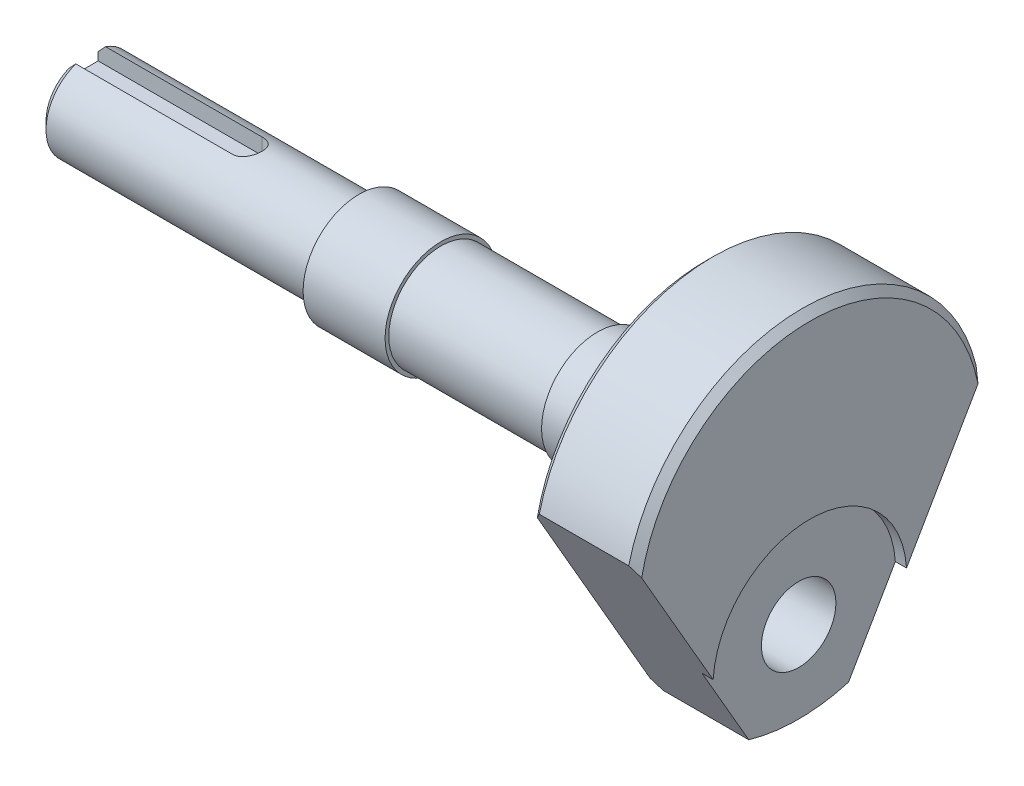
ISO-10303-21;
HEADER;
FILE_DESCRIPTION(('STEP AP214'),'2;1');
FILE_NAME('part.step','',(''),(''),'','','');
FILE_SCHEMA(('AUTOMOTIVE_DESIGN { 1 0 10303 214 1 1 1 1 }'));
ENDSEC;
DATA;
#1=APPLICATION_CONTEXT('core data for automotive mechanical design processes');
#2=APPLICATION_PROTOCOL_DEFINITION('international standard','automotive_design',2000,#1);
#3=PRODUCT_CONTEXT('',#1,'mechanical');
#4=PRODUCT('Part','Part','',(#3));
#5=PRODUCT_RELATED_PRODUCT_CATEGORY('part','',(#4));
#6=PRODUCT_DEFINITION_FORMATION('','',#4);
#7=PRODUCT_DEFINITION_CONTEXT('part definition',#1,'design');
#8=PRODUCT_DEFINITION('design','',#6,#7);
#9=PRODUCT_DEFINITION_SHAPE('','',#8);
#10=(LENGTH_UNIT() NAMED_UNIT(*) SI_UNIT(.MILLI.,.METRE.));
#11=(NAMED_UNIT(*) PLANE_ANGLE_UNIT() SI_UNIT($,.RADIAN.));
#12=(NAMED_UNIT(*) SI_UNIT($,.STERADIAN.) SOLID_ANGLE_UNIT());
#13=UNCERTAINTY_MEASURE_WITH_UNIT(LENGTH_MEASURE(1.E-05),#10,'distance_accuracy_value','');
#14=(GEOMETRIC_REPRESENTATION_CONTEXT(3) GLOBAL_UNCERTAINTY_ASSIGNED_CONTEXT((#13)) GLOBAL_UNIT_ASSIGNED_CONTEXT((#10,
#11,#12)) REPRESENTATION_CONTEXT('',''));
#15=CARTESIAN_POINT('',(0.,0.,0.));
#16=DIRECTION('',(0.,0.,1.));
#17=DIRECTION('',(1.,0.,0.));
#18=AXIS2_PLACEMENT_3D('',#15,#16,#17);
#19=CARTESIAN_POINT('',(0.,0.,0.));
#20=DIRECTION('',(-1.,0.,0.));
#21=DIRECTION('',(0.,0.,1.));
#22=AXIS2_PLACEMENT_3D('',#19,#20,#21);
#23=CYLINDRICAL_SURFACE('',#22,6.);
#24=CARTESIAN_POINT('',(37.,0.,0.));
#25=DIRECTION('',(-1.,0.,0.));
#26=DIRECTION('',(0.,0.,1.));
#27=AXIS2_PLACEMENT_3D('',#24,#25,#26);
#28=CIRCLE('',#27,6.);
#29=CARTESIAN_POINT('',(37.,0.,6.));
#30=VERTEX_POINT('',#29);
#31=EDGE_CURVE('E341',#30,#30,#28,.T.);
#32=ORIENTED_EDGE('',*,*,#31,.T.);
#33=EDGE_LOOP('',(#32));
#34=FACE_BOUND('',#33,.T.);
#35=CARTESIAN_POINT('',(22.,5.65685424949238,-2.));
#36=CARTESIAN_POINT('',(21.8910636503278,5.65685389060868,-2.00000051589543));
#37=CARTESIAN_POINT('',(21.7821304003528,5.66003538581715,-1.99106956737105));
#38=CARTESIAN_POINT('',(21.5674911580115,5.6723514816251,-1.95570226337762));
#39=CARTESIAN_POINT('',(21.461785700255,5.68148706284377,-1.9292630243368));
#40=CARTESIAN_POINT('',(21.2567462140054,5.70456407377583,-1.85991097136981));
#41=CARTESIAN_POINT('',(21.1574001411146,5.71849607942644,-1.81703044280649));
#42=CARTESIAN_POINT('',(20.9672799029041,5.74958244020649,-1.71612325688276));
#43=CARTESIAN_POINT('',(20.8765076348927,5.76673750607225,-1.65809325772037));
#44=CARTESIAN_POINT('',(20.7025600753234,5.80308978814946,-1.52610229288576));
#45=CARTESIAN_POINT('',(20.6197691426565,5.82233789689288,-1.45164868275584));
#46=CARTESIAN_POINT('',(20.4675863975507,5.86027729602006,-1.28997533442879));
#47=CARTESIAN_POINT('',(20.3981967368352,5.87896849657923,-1.20275355010475));
#48=CARTESIAN_POINT('',(20.2730422053408,5.91427733843598,-1.01520901593002));
#49=CARTESIAN_POINT('',(20.2176800587641,5.93082815403211,-0.914603822449051));
#50=CARTESIAN_POINT('',(20.124816829745,5.95939173541966,-0.704862445974947));
#51=CARTESIAN_POINT('',(20.0873109336462,5.97140572406004,-0.595728571374423));
#52=CARTESIAN_POINT('',(20.0325282907352,5.98918150863813,-0.376057634866987));
#53=CARTESIAN_POINT('',(20.014593107486,5.99514629555118,-0.265701509705935));
#54=CARTESIAN_POINT('',(19.9973674132787,6.00087216436496,-0.0433957496481767));
#55=CARTESIAN_POINT('',(19.9980720966952,6.00063484525791,0.0685534670877949));
#56=CARTESIAN_POINT('',(20.017688509132,5.99412079237463,0.286207030387632));
#57=CARTESIAN_POINT('',(20.035885056949,5.98808129510235,0.391984097183316));
#58=CARTESIAN_POINT('',(20.0887859619609,5.97093934679463,0.598886877644346));
#59=CARTESIAN_POINT('',(20.1234914379596,5.95983655262363,0.700012275558435));
#60=CARTESIAN_POINT('',(20.2088426346121,5.93351340586448,0.896304949683949));
#61=CARTESIAN_POINT('',(20.259691877093,5.91824085048031,0.991376441937694));
#62=CARTESIAN_POINT('',(20.3757194108973,5.88516786077838,1.17184865105465));
#63=CARTESIAN_POINT('',(20.4409016866553,5.86736672402934,1.25724666877069));
#64=CARTESIAN_POINT('',(20.5873487869194,5.83012383699793,1.42020173310262));
#65=CARTESIAN_POINT('',(20.669226315683,5.81064430337755,1.49720031413055));
#66=CARTESIAN_POINT('',(20.8448974514532,5.77294670497801,1.63655451919635));
#67=CARTESIAN_POINT('',(20.9386928914561,5.75472883491231,1.69890788656309));
#68=CARTESIAN_POINT('',(21.1373072512069,5.72141050242224,1.80797491007149));
#69=CARTESIAN_POINT('',(21.2422642626355,5.70635818569496,1.85445292724268));
#70=CARTESIAN_POINT('',(21.4591427884288,5.68163301648769,1.92888638653868));
#71=CARTESIAN_POINT('',(21.5710613624125,5.67195790974185,1.95684959149499));
#72=CARTESIAN_POINT('',(21.7932767108231,5.6595927263117,1.99232256419505));
#73=CARTESIAN_POINT('',(21.9034188494973,5.65660720637512,2.00069819101527));
#74=CARTESIAN_POINT('',(22.1235522982282,5.65713344118369,1.99921087781944));
#75=CARTESIAN_POINT('',(22.233543632048,5.66064401583629,1.98935125045353));
#76=CARTESIAN_POINT('',(22.4463139314238,5.67347236180599,1.95245130310462));
#77=CARTESIAN_POINT('',(22.5492108603017,5.6825865088168,1.92601278796137));
#78=CARTESIAN_POINT('',(22.7490872124784,5.70537107342046,1.85742772512094));
#79=CARTESIAN_POINT('',(22.8460655831815,5.71904229869679,1.81527839272685));
#80=CARTESIAN_POINT('',(23.034760841694,5.74993755191574,1.71494868147788));
#81=CARTESIAN_POINT('',(23.1262132852836,5.76726051331256,1.656302236717));
#82=CARTESIAN_POINT('',(23.2982921047674,5.8033153746193,1.52517126111512));
#83=CARTESIAN_POINT('',(23.3789152773224,5.82204768887589,1.45268265099756));
#84=CARTESIAN_POINT('',(23.5310559681813,5.85990077275698,1.29178341180065));
#85=CARTESIAN_POINT('',(23.6019487800377,5.87899687155793,1.2027745410933));
#86=CARTESIAN_POINT('',(23.7278322846961,5.91453703226217,1.01365458280051));
#87=CARTESIAN_POINT('',(23.7828235423248,5.93098118835389,0.913543889729104));
#88=CARTESIAN_POINT('',(23.8748402097234,5.95928811621206,0.70555972486459));
#89=CARTESIAN_POINT('',(23.9119825542961,5.97118060009062,0.597742246642392));
#90=CARTESIAN_POINT('',(23.9674554841202,5.98917221675549,0.376916931692032));
#91=CARTESIAN_POINT('',(23.985792859761,5.99527344068038,0.263910983907778));
#92=CARTESIAN_POINT('',(24.0025241552113,6.00083726472513,0.0416306717200808));
#93=CARTESIAN_POINT('',(24.0018149078647,6.00059840178878,-0.0675694478400379));
#94=CARTESIAN_POINT('',(23.9826853837072,5.99424393038796,-0.284222290000349));
#95=CARTESIAN_POINT('',(23.9642665436945,5.98812879867152,-0.391675153638116));
#96=CARTESIAN_POINT('',(23.9108355308481,5.97081829908825,-0.60008423886412));
#97=CARTESIAN_POINT('',(23.8760915692941,5.95970516722297,-0.70111654182558));
#98=CARTESIAN_POINT('',(23.7912449378057,5.9335432140899,-0.895956701879594));
#99=CARTESIAN_POINT('',(23.741139489606,5.91849368096033,-0.989763248284868));
#100=CARTESIAN_POINT('',(23.624860975796,5.88531737655762,-1.17126803261757));
#101=CARTESIAN_POINT('',(23.5581626292367,5.86709744983853,-1.25861250311522));
#102=CARTESIAN_POINT('',(23.4114852176876,5.82985977583759,-1.42116205254486));
#103=CARTESIAN_POINT('',(23.3315019154745,5.81084177546194,-1.49636324324919));
#104=CARTESIAN_POINT('',(23.1567812888261,5.77326559651196,-1.63548361766624));
#105=CARTESIAN_POINT('',(23.0615889780467,5.75475455977261,-1.69884593199581));
#106=CARTESIAN_POINT('',(22.8613311461944,5.7212038664603,-1.80862868660223));
#107=CARTESIAN_POINT('',(22.7562682139407,5.70616330322498,-1.85505355363895));
#108=CARTESIAN_POINT('',(22.5440763519687,5.68202668413029,-1.92768765640833));
#109=CARTESIAN_POINT('',(22.4372554729493,5.67269265714364,-1.95471581829904));
#110=CARTESIAN_POINT('',(22.2202878990666,5.66010767079036,-1.99086864029854));
#111=CARTESIAN_POINT('',(22.1101423651786,5.65685461234922,-1.99999947839319));
#112=CARTESIAN_POINT('',(22.,5.65685424949238,-2.));
#113=B_SPLINE_CURVE_WITH_KNOTS('',3,(#35,#36,#37,#38,#39,#40,#41,#42,#43,#44,#45,#46,#47,#48,
#49,#50,#51,#52,#53,#54,#55,#56,#57,#58,#59,#60,#61,#62,#63,#64,#65,#66,#67,#68,#69,#70,#71,#72,
#73,#74,#75,#76,#77,#78,#79,#80,#81,#82,#83,#84,#85,#86,#87,#88,#89,#90,#91,#92,#93,#94,#95,#96,
#97,#98,#99,#100,#101,#102,#103,#104,#105,#106,#107,#108,#109,#110,#111,#112),.UNSPECIFIED.,.T.,
.F.,(4,2,2,2,2,2,2,2,2,2,2,2,2,2,2,2,2,2,2,2,2,2,2,2,2,2,2,2,2,2,2,2,2,2,2,2,2,2,4),(0.,
0.326401169598714,0.65285611003033,0.978673255001661,1.30456233237089,1.64202674855137,
1.97954530343976,2.32587012287315,2.67210152773579,3.00628637529869,3.34038506604655,
3.66138009651139,3.98239688378474,4.30763309720671,4.63295983748045,4.97360348727836,
5.31429959224213,5.65985279686112,6.00526102713233,6.3350858272888,6.66485071674468,
6.98328791537553,7.30178158293892,7.63037715471431,7.95906971324256,8.30357616342187,
8.64807037515066,8.99027582381705,9.33235766008315,9.65836169355272,9.98433928019564,
10.3051391208086,10.6259970152649,10.9587103904127,11.2915300886526,11.6373780547229,
11.9831355653374,12.3132642432538,12.6432789438093),.UNSPECIFIED.);
#114=CARTESIAN_POINT('',(22.,5.65685424949238,2.));
#115=VERTEX_POINT('',#114);
#116=CARTESIAN_POINT('',(22.,5.65685424949238,-2.));
#117=VERTEX_POINT('',#116);
#118=EDGE_CURVE('E178',#115,#117,#113,.T.);
#119=ORIENTED_EDGE('',*,*,#118,.F.);
#120=DIRECTION('',(-1.,0.,0.));
#121=VECTOR('',#120,1.);
#122=CARTESIAN_POINT('',(0.,5.65685424949238,2.));
#123=LINE('',#122,#121);
#124=CARTESIAN_POINT('',(1.,5.65685424949238,2.));
#125=VERTEX_POINT('',#124);
#126=EDGE_CURVE('E438',#115,#125,#123,.T.);
#127=ORIENTED_EDGE('',*,*,#126,.T.);
#128=CARTESIAN_POINT('',(1.,0.,0.));
#129=DIRECTION('',(1.,0.,0.));
#130=DIRECTION('',(0.,0.,-1.));
#131=AXIS2_PLACEMENT_3D('',#128,#129,#130);
#132=CIRCLE('',#131,6.);
#133=CARTESIAN_POINT('',(1.,5.65685424949238,-2.));
#134=VERTEX_POINT('',#133);
#135=EDGE_CURVE('E335',#125,#134,#132,.T.);
#136=ORIENTED_EDGE('',*,*,#135,.T.);
#137=DIRECTION('',(-1.,0.,0.));
#138=VECTOR('',#137,1.);
#139=CARTESIAN_POINT('',(0.,5.65685424949238,-2.));
#140=LINE('',#139,#138);
#141=EDGE_CURVE('E440',#134,#117,#140,.F.);
#142=ORIENTED_EDGE('',*,*,#141,.T.);
#143=EDGE_LOOP('',(#119,#127,#136,#142));
#144=FACE_BOUND('',#143,.T.);
#145=ADVANCED_FACE('F43',(#34,#144),#23,.T.);
#146=CARTESIAN_POINT('',(0.,0.,0.));
#147=DIRECTION('',(-1.,0.,0.));
#148=DIRECTION('',(0.,0.,1.));
#149=AXIS2_PLACEMENT_3D('',#146,#147,#148);
#150=CYLINDRICAL_SURFACE('',#149,24.);
#151=CARTESIAN_POINT('',(96.,0.,0.));
#152=DIRECTION('',(1.,0.,0.));
#153=DIRECTION('',(0.,0.,-1.));
#154=AXIS2_PLACEMENT_3D('',#151,#152,#153);
#155=CIRCLE('',#154,24.);
#156=CARTESIAN_POINT('',(96.,-23.0477486077825,6.69337613708202));
#157=VERTEX_POINT('',#156);
#158=CARTESIAN_POINT('',(96.,-23.0477486077825,-6.69337613708202));
#159=VERTEX_POINT('',#158);
#160=EDGE_CURVE('E403',#157,#159,#155,.T.);
#161=ORIENTED_EDGE('',*,*,#160,.F.);
#162=DIRECTION('',(-1.,0.,0.));
#163=VECTOR('',#162,1.);
#164=CARTESIAN_POINT('',(0.,-23.0477486077825,6.69337613708203));
#165=LINE('',#164,#163);
#166=CARTESIAN_POINT('',(84.5,-23.0477486077825,6.69337613708202));
#167=VERTEX_POINT('',#166);
#168=EDGE_CURVE('E391',#167,#157,#165,.F.);
#169=ORIENTED_EDGE('',*,*,#168,.F.);
#170=CARTESIAN_POINT('',(84.5,0.,0.));
#171=DIRECTION('',(1.,0.,0.));
#172=DIRECTION('',(0.,0.,-1.));
#173=AXIS2_PLACEMENT_3D('',#170,#171,#172);
#174=CIRCLE('',#173,24.);
#175=CARTESIAN_POINT('',(84.5,-23.0477486077825,-6.69337613708202));
#176=VERTEX_POINT('',#175);
#177=EDGE_CURVE('E334',#167,#176,#174,.T.);
#178=ORIENTED_EDGE('',*,*,#177,.T.);
#179=DIRECTION('',(-1.,0.,0.));
#180=VECTOR('',#179,1.);
#181=CARTESIAN_POINT('',(0.,-23.0477486077825,-6.69337613708202));
#182=LINE('',#181,#180);
#183=EDGE_CURVE('E376',#176,#159,#182,.F.);
#184=ORIENTED_EDGE('',*,*,#183,.T.);
#185=EDGE_LOOP('',(#161,#169,#178,#184));
#186=FACE_BOUND('',#185,.T.);
#187=ADVANCED_FACE('F226',(#186),#150,.T.);
#188=CARTESIAN_POINT('',(83.5,11.5,0.));
#189=DIRECTION('',(1.,0.,0.));
#190=DIRECTION('',(0.,0.,-1.));
#191=AXIS2_PLACEMENT_3D('',#188,#189,#190);
#192=PLANE('',#191);
#193=CARTESIAN_POINT('',(83.5,0.,0.));
#194=DIRECTION('',(-1.,0.,0.));
#195=DIRECTION('',(0.,0.,1.));
#196=AXIS2_PLACEMENT_3D('',#193,#194,#195);
#197=CIRCLE('',#196,11.5);
#198=CARTESIAN_POINT('',(83.5,-10.625,4.39992897669951));
#199=VERTEX_POINT('',#198);
#200=CARTESIAN_POINT('',(83.5,-10.625,-4.39992897669951));
#201=VERTEX_POINT('',#200);
#202=EDGE_CURVE('E365',#199,#201,#197,.T.);
#203=ORIENTED_EDGE('',*,*,#202,.F.);
#204=CARTESIAN_POINT('',(83.5,-13.,0.));
#205=DIRECTION('',(1.,0.,0.));
#206=DIRECTION('',(0.,0.,-1.));
#207=AXIS2_PLACEMENT_3D('',#204,#205,#206);
#208=CIRCLE('',#207,5.);
#209=EDGE_CURVE('E71',#199,#201,#208,.T.);
#210=ORIENTED_EDGE('',*,*,#209,.T.);
#211=EDGE_LOOP('',(#203,#210));
#212=FACE_BOUND('',#211,.T.);
#213=DIRECTION('',(0.,-0.86602540378444,-0.499999999999998));
#214=VECTOR('',#213,1.);
#215=CARTESIAN_POINT('',(83.5,-0.0352540378443338,19.9796460717606));
#216=LINE('',#215,#214);
#217=CARTESIAN_POINT('',(83.5,4.44508838423677,22.5663729752108));
#218=VERTEX_POINT('',#217);
#219=CARTESIAN_POINT('',(83.5,-21.7655964599255,7.43362702478934));
#220=VERTEX_POINT('',#219);
#221=EDGE_CURVE('E394',#218,#220,#216,.T.);
#222=ORIENTED_EDGE('',*,*,#221,.F.);
#223=CARTESIAN_POINT('',(83.5,0.,0.));
#224=DIRECTION('',(1.,0.,0.));
#225=DIRECTION('',(0.,0.,-1.));
#226=AXIS2_PLACEMENT_3D('',#223,#224,#225);
#227=CIRCLE('',#226,23.);
#228=CARTESIAN_POINT('',(83.5,4.44508838423677,-22.5663729752108));
#229=VERTEX_POINT('',#228);
#230=EDGE_CURVE('E321',#218,#229,#227,.F.);
#231=ORIENTED_EDGE('',*,*,#230,.T.);
#232=DIRECTION('',(0.,-0.86602540378444,0.499999999999998));
#233=VECTOR('',#232,1.);
#234=CARTESIAN_POINT('',(83.5,-0.0352540378443303,-19.9796460717606));
#235=LINE('',#234,#233);
#236=CARTESIAN_POINT('',(83.5,-21.7655964599255,-7.43362702478933));
#237=VERTEX_POINT('',#236);
#238=EDGE_CURVE('E379',#229,#237,#235,.T.);
#239=ORIENTED_EDGE('',*,*,#238,.T.);
#240=EDGE_CURVE('E317',#237,#220,#227,.F.);
#241=ORIENTED_EDGE('',*,*,#240,.T.);
#242=EDGE_LOOP('',(#222,#231,#239,#241));
#243=FACE_BOUND('',#242,.T.);
#244=ADVANCED_FACE('F224',(#212,#243),#192,.F.);
#245=DIRECTION('',(-1.,0.,0.));
#246=VECTOR('',#245,1.);
#247=CARTESIAN_POINT('',(367.531202733106,5.7272405320938,23.3066238629181));
#248=LINE('',#247,#246);
#249=CARTESIAN_POINT('',(96.5,5.7272405320938,23.3066238629181));
#250=VERTEX_POINT('',#249);
#251=CARTESIAN_POINT('',(84.5,5.7272405320938,23.3066238629181));
#252=VERTEX_POINT('',#251);
#253=EDGE_CURVE('E396',#250,#252,#248,.T.);
#254=ORIENTED_EDGE('',*,*,#253,.F.);
#255=CARTESIAN_POINT('',(96.5,0.,0.));
#256=DIRECTION('',(-1.,0.,0.));
#257=DIRECTION('',(0.,0.,1.));
#258=AXIS2_PLACEMENT_3D('',#255,#256,#257);
#259=CIRCLE('',#258,24.);
#260=CARTESIAN_POINT('',(96.5,5.7272405320938,-23.3066238629181));
#261=VERTEX_POINT('',#260);
#262=EDGE_CURVE('E329',#250,#261,#259,.T.);
#263=ORIENTED_EDGE('',*,*,#262,.T.);
#264=DIRECTION('',(-1.,0.,0.));
#265=VECTOR('',#264,1.);
#266=CARTESIAN_POINT('',(367.879261302496,5.7272405320938,-23.3066238629181));
#267=LINE('',#266,#265);
#268=CARTESIAN_POINT('',(84.5,5.7272405320938,-23.3066238629181));
#269=VERTEX_POINT('',#268);
#270=EDGE_CURVE('E381',#261,#269,#267,.T.);
#271=ORIENTED_EDGE('',*,*,#270,.T.);
#272=EDGE_CURVE('E331',#269,#252,#174,.T.);
#273=ORIENTED_EDGE('',*,*,#272,.T.);
#274=EDGE_LOOP('',(#254,#263,#271,#273));
#275=FACE_BOUND('',#274,.T.);
#276=ADVANCED_FACE('F220',(#275),#150,.T.);
#277=CARTESIAN_POINT('',(97.5,24.,0.));
#278=DIRECTION('',(-1.,0.,0.));
#279=DIRECTION('',(0.,0.,1.));
#280=AXIS2_PLACEMENT_3D('',#277,#278,#279);
#281=PLANE('',#280);
#282=DIRECTION('',(0.,0.86602540378444,0.499999999999998));
#283=VECTOR('',#282,1.);
#284=CARTESIAN_POINT('',(97.5,9.3397459621557,25.3923048454133));
#285=LINE('',#284,#283);
#286=CARTESIAN_POINT('',(97.5,-12.1702657575698,12.9734937887579));
#287=VERTEX_POINT('',#286);
#288=CARTESIAN_POINT('',(97.5,4.44508838423677,22.5663729752108));
#289=VERTEX_POINT('',#288);
#290=EDGE_CURVE('E389',#287,#289,#285,.T.);
#291=ORIENTED_EDGE('',*,*,#290,.F.);
#292=CARTESIAN_POINT('',(97.5,-13.,0.));
#293=DIRECTION('',(1.,0.,0.));
#294=DIRECTION('',(0.,0.,-1.));
#295=AXIS2_PLACEMENT_3D('',#292,#293,#294);
#296=CIRCLE('',#295,13.);
#297=CARTESIAN_POINT('',(97.5,-12.1702657575698,-12.9734937887579));
#298=VERTEX_POINT('',#297);
#299=EDGE_CURVE('E253',#298,#287,#296,.T.);
#300=ORIENTED_EDGE('',*,*,#299,.F.);
#301=DIRECTION('',(0.,0.86602540378444,-0.499999999999998));
#302=VECTOR('',#301,1.);
#303=CARTESIAN_POINT('',(97.5,9.3397459621557,-25.3923048454133));
#304=LINE('',#303,#302);
#305=CARTESIAN_POINT('',(97.5,4.44508838423677,-22.5663729752108));
#306=VERTEX_POINT('',#305);
#307=EDGE_CURVE('E374',#298,#306,#304,.T.);
#308=ORIENTED_EDGE('',*,*,#307,.T.);
#309=CARTESIAN_POINT('',(97.5,0.,0.));
#310=DIRECTION('',(-1.,0.,0.));
#311=DIRECTION('',(0.,0.,1.));
#312=AXIS2_PLACEMENT_3D('',#309,#310,#311);
#313=CIRCLE('',#312,23.);
#314=EDGE_CURVE('E325',#306,#289,#313,.F.);
#315=ORIENTED_EDGE('',*,*,#314,.T.);
#316=EDGE_LOOP('',(#291,#300,#308,#315));
#317=FACE_BOUND('',#316,.T.);
#318=ADVANCED_FACE('F216',(#317),#281,.F.);
#319=CARTESIAN_POINT('',(96.5,0.,0.));
#320=DIRECTION('',(-1.,0.,0.));
#321=DIRECTION('',(0.,0.,1.));
#322=AXIS2_PLACEMENT_3D('',#319,#320,#321);
#323=CONICAL_SURFACE('',#322,24.,0.785398163397457);
#324=ORIENTED_EDGE('',*,*,#262,.F.);
#325=CARTESIAN_POINT('',(96.4998401383705,5.7274405320938,23.3067393329719));
#326=CARTESIAN_POINT('',(96.5846119176422,5.62138399175425,23.2455075608575));
#327=CARTESIAN_POINT('',(96.6690542967704,5.51512976042569,23.1841616517975));
#328=CARTESIAN_POINT('',(96.8372441561352,5.30221504900769,23.0612352858459));
#329=CARTESIAN_POINT('',(96.9209916603313,5.19555458311198,22.9996548371491));
#330=CARTESIAN_POINT('',(97.0877617324435,4.98180895475866,22.8762487410812));
#331=CARTESIAN_POINT('',(97.1707842987406,4.87472379135331,22.8144230931629));
#332=CARTESIAN_POINT('',(97.336070885304,4.66010998815588,22.690515756115));
#333=CARTESIAN_POINT('',(97.4183348792044,4.55258133313576,22.6284340581936));
#334=CARTESIAN_POINT('',(97.5002,4.44482513131747,22.5662209860669));
#335=B_SPLINE_CURVE_WITH_KNOTS('',3,(#325,#326,#327,#328,#329,#330,#331,#332,#333,#334),
.UNSPECIFIED.,.F.,.F.,(4,2,2,2,4),(0.,0.446824302286733,0.893633133308687,1.34044296198653,
1.78726826254038),.UNSPECIFIED.);
#336=EDGE_CURVE('E383',#250,#289,#335,.T.);
#337=ORIENTED_EDGE('',*,*,#336,.T.);
#338=ORIENTED_EDGE('',*,*,#314,.F.);
#339=CARTESIAN_POINT('',(96.4998401383705,5.7274405320938,-23.3067393329719));
#340=CARTESIAN_POINT('',(96.5846119176422,5.62138399175425,-23.2455075608575));
#341=CARTESIAN_POINT('',(96.6690542967704,5.51512976042569,-23.1841616517975));
#342=CARTESIAN_POINT('',(96.8372441561352,5.30221504900769,-23.0612352858459));
#343=CARTESIAN_POINT('',(96.9209916603313,5.19555458311197,-22.9996548371491));
#344=CARTESIAN_POINT('',(97.0877617324435,4.98180895475866,-22.8762487410812));
#345=CARTESIAN_POINT('',(97.1707842987406,4.87472379135331,-22.8144230931629));
#346=CARTESIAN_POINT('',(97.336070885304,4.66010998815588,-22.690515756115));
#347=CARTESIAN_POINT('',(97.4183348792044,4.55258133313577,-22.6284340581936));
#348=CARTESIAN_POINT('',(97.5002,4.44482513131747,-22.5662209860669));
#349=B_SPLINE_CURVE_WITH_KNOTS('',3,(#339,#340,#341,#342,#343,#344,#345,#346,#347,#348),
.UNSPECIFIED.,.F.,.F.,(4,2,2,2,4),(0.,0.446824302286733,0.893633133308686,1.34044296198654,
1.78726826254038),.UNSPECIFIED.);
#350=EDGE_CURVE('E368',#261,#306,#349,.T.);
#351=ORIENTED_EDGE('',*,*,#350,.F.);
#352=EDGE_LOOP('',(#324,#337,#338,#351));
#353=FACE_BOUND('',#352,.T.);
#354=ADVANCED_FACE('F213',(#353),#323,.T.);
#355=CARTESIAN_POINT('',(83.5,0.,0.));
#356=DIRECTION('',(1.,0.,0.));
#357=DIRECTION('',(0.,0.,-1.));
#358=AXIS2_PLACEMENT_3D('',#355,#356,#357);
#359=CONICAL_SURFACE('',#358,23.,0.785398163397457);
#360=ORIENTED_EDGE('',*,*,#177,.F.);
#361=CARTESIAN_POINT('',(84.5002000000002,-23.0479988239464,6.69323167471245));
#362=CARTESIAN_POINT('',(84.4154247715848,-22.9419381611846,6.75446582690843));
#363=CARTESIAN_POINT('',(84.3309789668305,-22.8356797929439,6.8158141244158));
#364=CARTESIAN_POINT('',(84.1627823072917,-22.6227567774634,6.93874528472015));
#365=CARTESIAN_POINT('',(84.0790314285442,-22.5160921444193,7.00032813932117));
#366=CARTESIAN_POINT('',(83.9122546617587,-22.3023381494211,7.12373906587373));
#367=CARTESIAN_POINT('',(83.8292287753401,-22.1952487865191,7.18556713837255));
#368=CARTESIAN_POINT('',(83.6639356068591,-21.9806265498149,7.3094793445078));
#369=CARTESIAN_POINT('',(83.5816683511667,-21.8730936607824,7.37156348693746));
#370=CARTESIAN_POINT('',(83.4998,-21.7653332070062,7.43377901393315));
#371=B_SPLINE_CURVE_WITH_KNOTS('',3,(#361,#362,#363,#364,#365,#366,#367,#368,#369,#370),
.UNSPECIFIED.,.F.,.F.,(4,2,2,2,4),(0.,0.446841933420566,0.893668393849767,1.3404958520852,
1.7873387839233),.UNSPECIFIED.);
#372=EDGE_CURVE('E286',#167,#220,#371,.T.);
#373=ORIENTED_EDGE('',*,*,#372,.T.);
#374=ORIENTED_EDGE('',*,*,#240,.F.);
#375=CARTESIAN_POINT('',(84.5002000000002,-23.0479988239464,-6.69323167471245));
#376=CARTESIAN_POINT('',(84.4154247715848,-22.9419381611846,-6.75446582690843));
#377=CARTESIAN_POINT('',(84.3309789668305,-22.8356797929439,-6.8158141244158));
#378=CARTESIAN_POINT('',(84.1627823072917,-22.6227567774634,-6.93874528472014));
#379=CARTESIAN_POINT('',(84.0790314285442,-22.5160921444193,-7.00032813932117));
#380=CARTESIAN_POINT('',(83.9122546617587,-22.3023381494211,-7.12373906587373));
#381=CARTESIAN_POINT('',(83.8292287753401,-22.1952487865191,-7.18556713837255));
#382=CARTESIAN_POINT('',(83.6639356068591,-21.9806265498149,-7.3094793445078));
#383=CARTESIAN_POINT('',(83.5816683511667,-21.8730936607824,-7.37156348693746));
#384=CARTESIAN_POINT('',(83.4998,-21.7653332070062,-7.43377901393315));
#385=B_SPLINE_CURVE_WITH_KNOTS('',3,(#375,#376,#377,#378,#379,#380,#381,#382,#383,#384),
.UNSPECIFIED.,.F.,.F.,(4,2,2,2,4),(0.,0.446841933420566,0.893668393849767,1.34049585208519,
1.7873387839233),.UNSPECIFIED.);
#386=EDGE_CURVE('E306',#176,#237,#385,.T.);
#387=ORIENTED_EDGE('',*,*,#386,.F.);
#388=EDGE_LOOP('',(#360,#373,#374,#387));
#389=FACE_BOUND('',#388,.T.);
#390=ADVANCED_FACE('F292',(#389),#359,.T.);
#391=ORIENTED_EDGE('',*,*,#230,.F.);
#392=CARTESIAN_POINT('',(83.4998,4.44482513131746,22.5662209860669));
#393=CARTESIAN_POINT('',(83.5816651207956,4.55258133313576,22.6284340581936));
#394=CARTESIAN_POINT('',(83.663929114696,4.66010998815588,22.690515756115));
#395=CARTESIAN_POINT('',(83.8292157012594,4.87472379135331,22.8144230931629));
#396=CARTESIAN_POINT('',(83.9122382675565,4.98180895475866,22.8762487410812));
#397=CARTESIAN_POINT('',(84.0790083396687,5.19555458311197,22.9996548371491));
#398=CARTESIAN_POINT('',(84.1627558438648,5.30221504900768,23.0612352858459));
#399=CARTESIAN_POINT('',(84.3309457032296,5.51512976042568,23.1841616517975));
#400=CARTESIAN_POINT('',(84.4153880823579,5.62138399175425,23.2455075608575));
#401=CARTESIAN_POINT('',(84.5001598616295,5.7274405320938,23.3067393329719));
#402=B_SPLINE_CURVE_WITH_KNOTS('',3,(#392,#393,#394,#395,#396,#397,#398,#399,#400,#401),
.UNSPECIFIED.,.F.,.F.,(4,2,2,2,4),(0.,0.446825300553836,0.893635129231689,1.34044396025362,
1.78726826254038),.UNSPECIFIED.);
#403=EDGE_CURVE('E279',#218,#252,#402,.T.);
#404=ORIENTED_EDGE('',*,*,#403,.T.);
#405=ORIENTED_EDGE('',*,*,#272,.F.);
#406=CARTESIAN_POINT('',(83.4998,4.44482513131747,-22.5662209860669));
#407=CARTESIAN_POINT('',(83.5816651207956,4.55258133313577,-22.6284340581936));
#408=CARTESIAN_POINT('',(83.663929114696,4.66010998815589,-22.690515756115));
#409=CARTESIAN_POINT('',(83.8292157012594,4.87472379135331,-22.8144230931629));
#410=CARTESIAN_POINT('',(83.9122382675565,4.98180895475866,-22.8762487410812));
#411=CARTESIAN_POINT('',(84.0790083396688,5.19555458311198,-22.9996548371491));
#412=CARTESIAN_POINT('',(84.1627558438649,5.30221504900769,-23.0612352858459));
#413=CARTESIAN_POINT('',(84.3309457032296,5.51512976042569,-23.1841616517975));
#414=CARTESIAN_POINT('',(84.4153880823579,5.62138399175425,-23.2455075608576));
#415=CARTESIAN_POINT('',(84.5001598616295,5.7274405320938,-23.3067393329719));
#416=B_SPLINE_CURVE_WITH_KNOTS('',3,(#406,#407,#408,#409,#410,#411,#412,#413,#414,#415),
.UNSPECIFIED.,.F.,.F.,(4,2,2,2,4),(0.,0.446825300553832,0.893635129231693,1.34044396025364,
1.78726826254037),.UNSPECIFIED.);
#417=EDGE_CURVE('E300',#229,#269,#416,.T.);
#418=ORIENTED_EDGE('',*,*,#417,.F.);
#419=EDGE_LOOP('',(#391,#404,#405,#418));
#420=FACE_BOUND('',#419,.T.);
#421=ADVANCED_FACE('F295',(#420),#359,.T.);
#422=CARTESIAN_POINT('',(0.,0.,0.));
#423=DIRECTION('',(1.,0.,0.));
#424=DIRECTION('',(0.,0.,-1.));
#425=AXIS2_PLACEMENT_3D('',#422,#423,#424);
#426=PLANE('',#425);
#427=CARTESIAN_POINT('',(0.,0.,0.));
#428=DIRECTION('',(-1.,0.,0.));
#429=DIRECTION('',(0.,0.,1.));
#430=AXIS2_PLACEMENT_3D('',#427,#428,#429);
#431=CIRCLE('',#430,1.64999999999999);
#432=CARTESIAN_POINT('',(0.,0.,1.64999999999999));
#433=VERTEX_POINT('',#432);
#434=EDGE_CURVE('E170',#433,#433,#431,.T.);
#435=ORIENTED_EDGE('',*,*,#434,.F.);
#436=EDGE_LOOP('',(#435));
#437=FACE_BOUND('',#436,.T.);
#438=DIRECTION('',(0.,0.,1.));
#439=VECTOR('',#438,1.);
#440=CARTESIAN_POINT('',(0.,3.5,-2.));
#441=LINE('',#440,#439);
#442=CARTESIAN_POINT('',(0.,3.5,-2.));
#443=VERTEX_POINT('',#442);
#444=CARTESIAN_POINT('',(0.,3.5,2.));
#445=VERTEX_POINT('',#444);
#446=EDGE_CURVE('E510',#443,#445,#441,.T.);
#447=ORIENTED_EDGE('',*,*,#446,.F.);
#448=DIRECTION('',(0.,-1.,0.));
#449=VECTOR('',#448,1.);
#450=CARTESIAN_POINT('',(0.,7.27639203829714,-2.));
#451=LINE('',#450,#449);
#452=CARTESIAN_POINT('',(0.,4.58257569495584,-2.));
#453=VERTEX_POINT('',#452);
#454=EDGE_CURVE('E183',#453,#443,#451,.T.);
#455=ORIENTED_EDGE('',*,*,#454,.F.);
#456=CARTESIAN_POINT('',(0.,0.,0.));
#457=DIRECTION('',(1.,0.,0.));
#458=DIRECTION('',(0.,0.,-1.));
#459=AXIS2_PLACEMENT_3D('',#456,#457,#458);
#460=CIRCLE('',#459,5.);
#461=CARTESIAN_POINT('',(0.,4.58257569495584,2.));
#462=VERTEX_POINT('',#461);
#463=EDGE_CURVE('E338',#453,#462,#460,.F.);
#464=ORIENTED_EDGE('',*,*,#463,.T.);
#465=DIRECTION('',(0.,1.,0.));
#466=VECTOR('',#465,1.);
#467=CARTESIAN_POINT('',(0.,7.27639203829714,2.));
#468=LINE('',#467,#466);
#469=EDGE_CURVE('E63',#445,#462,#468,.T.);
#470=ORIENTED_EDGE('',*,*,#469,.F.);
#471=EDGE_LOOP('',(#447,#455,#464,#470));
#472=FACE_BOUND('',#471,.T.);
#473=ADVANCED_FACE('F45',(#437,#472),#426,.F.);
#474=CARTESIAN_POINT('',(37.,6.,0.));
#475=DIRECTION('',(1.,0.,0.));
#476=DIRECTION('',(0.,0.,-1.));
#477=AXIS2_PLACEMENT_3D('',#474,#475,#476);
#478=PLANE('',#477);
#479=ORIENTED_EDGE('',*,*,#31,.F.);
#480=EDGE_LOOP('',(#479));
#481=FACE_BOUND('',#480,.T.);
#482=CARTESIAN_POINT('',(37.,0.,0.));
#483=DIRECTION('',(-1.,0.,0.));
#484=DIRECTION('',(0.,0.,1.));
#485=AXIS2_PLACEMENT_3D('',#482,#483,#484);
#486=CIRCLE('',#485,7.5);
#487=CARTESIAN_POINT('',(37.,0.,7.5));
#488=VERTEX_POINT('',#487);
#489=EDGE_CURVE('E344',#488,#488,#486,.T.);
#490=ORIENTED_EDGE('',*,*,#489,.T.);
#491=EDGE_LOOP('',(#490));
#492=FACE_BOUND('',#491,.T.);
#493=ADVANCED_FACE('F485',(#481,#492),#478,.F.);
#494=CARTESIAN_POINT('',(0.,0.,0.));
#495=DIRECTION('',(-1.,0.,0.));
#496=DIRECTION('',(0.,0.,1.));
#497=AXIS2_PLACEMENT_3D('',#494,#495,#496);
#498=CYLINDRICAL_SURFACE('',#497,7.5);
#499=ORIENTED_EDGE('',*,*,#489,.F.);
#500=EDGE_LOOP('',(#499));
#501=FACE_BOUND('',#500,.T.);
#502=CARTESIAN_POINT('',(48.,0.,0.));
#503=DIRECTION('',(-1.,0.,0.));
#504=DIRECTION('',(0.,0.,1.));
#505=AXIS2_PLACEMENT_3D('',#502,#503,#504);
#506=CIRCLE('',#505,7.5);
#507=CARTESIAN_POINT('',(48.,0.,7.5));
#508=VERTEX_POINT('',#507);
#509=EDGE_CURVE('E347',#508,#508,#506,.T.);
#510=ORIENTED_EDGE('',*,*,#509,.T.);
#511=EDGE_LOOP('',(#510));
#512=FACE_BOUND('',#511,.T.);
#513=ADVANCED_FACE('F482',(#501,#512),#498,.T.);
#514=CARTESIAN_POINT('',(48.,7.5,0.));
#515=DIRECTION('',(-1.,0.,0.));
#516=DIRECTION('',(0.,0.,1.));
#517=AXIS2_PLACEMENT_3D('',#514,#515,#516);
#518=PLANE('',#517);
#519=ORIENTED_EDGE('',*,*,#509,.F.);
#520=EDGE_LOOP('',(#519));
#521=FACE_BOUND('',#520,.T.);
#522=CARTESIAN_POINT('',(48.,0.,0.));
#523=DIRECTION('',(-1.,0.,0.));
#524=DIRECTION('',(0.,0.,1.));
#525=AXIS2_PLACEMENT_3D('',#522,#523,#524);
#526=CIRCLE('',#525,6.99999999999999);
#527=CARTESIAN_POINT('',(48.,0.,6.99999999999999));
#528=VERTEX_POINT('',#527);
#529=EDGE_CURVE('E350',#528,#528,#526,.T.);
#530=ORIENTED_EDGE('',*,*,#529,.T.);
#531=EDGE_LOOP('',(#530));
#532=FACE_BOUND('',#531,.T.);
#533=ADVANCED_FACE('F478',(#521,#532),#518,.F.);
#534=CARTESIAN_POINT('',(0.,0.,0.));
#535=DIRECTION('',(-1.,0.,0.));
#536=DIRECTION('',(0.,0.,1.));
#537=AXIS2_PLACEMENT_3D('',#534,#535,#536);
#538=CYLINDRICAL_SURFACE('',#537,6.99999999999999);
#539=ORIENTED_EDGE('',*,*,#529,.F.);
#540=EDGE_LOOP('',(#539));
#541=FACE_BOUND('',#540,.T.);
#542=CARTESIAN_POINT('',(69.,0.,0.));
#543=DIRECTION('',(-1.,0.,0.));
#544=DIRECTION('',(0.,0.,1.));
#545=AXIS2_PLACEMENT_3D('',#542,#543,#544);
#546=CIRCLE('',#545,6.99999999999999);
#547=CARTESIAN_POINT('',(69.,0.,6.99999999999999));
#548=VERTEX_POINT('',#547);
#549=EDGE_CURVE('E353',#548,#548,#546,.T.);
#550=ORIENTED_EDGE('',*,*,#549,.T.);
#551=EDGE_LOOP('',(#550));
#552=FACE_BOUND('',#551,.T.);
#553=ADVANCED_FACE('F471',(#541,#552),#538,.T.);
#554=CARTESIAN_POINT('',(69.,6.99999999999999,0.));
#555=DIRECTION('',(1.,0.,0.));
#556=DIRECTION('',(0.,0.,-1.));
#557=AXIS2_PLACEMENT_3D('',#554,#555,#556);
#558=PLANE('',#557);
#559=ORIENTED_EDGE('',*,*,#549,.F.);
#560=EDGE_LOOP('',(#559));
#561=FACE_BOUND('',#560,.T.);
#562=CARTESIAN_POINT('',(69.,0.,0.));
#563=DIRECTION('',(-1.,0.,0.));
#564=DIRECTION('',(0.,0.,1.));
#565=AXIS2_PLACEMENT_3D('',#562,#563,#564);
#566=CIRCLE('',#565,7.5);
#567=CARTESIAN_POINT('',(69.,0.,7.5));
#568=VERTEX_POINT('',#567);
#569=EDGE_CURVE('E356',#568,#568,#566,.T.);
#570=ORIENTED_EDGE('',*,*,#569,.T.);
#571=EDGE_LOOP('',(#570));
#572=FACE_BOUND('',#571,.T.);
#573=ADVANCED_FACE('F464',(#561,#572),#558,.F.);
#574=CARTESIAN_POINT('',(0.,0.,0.));
#575=DIRECTION('',(-1.,0.,0.));
#576=DIRECTION('',(0.,0.,1.));
#577=AXIS2_PLACEMENT_3D('',#574,#575,#576);
#578=CYLINDRICAL_SURFACE('',#577,7.5);
#579=ORIENTED_EDGE('',*,*,#569,.F.);
#580=EDGE_LOOP('',(#579));
#581=FACE_BOUND('',#580,.T.);
#582=CARTESIAN_POINT('',(80.,0.,0.));
#583=DIRECTION('',(-1.,0.,0.));
#584=DIRECTION('',(0.,0.,1.));
#585=AXIS2_PLACEMENT_3D('',#582,#583,#584);
#586=CIRCLE('',#585,7.5);
#587=CARTESIAN_POINT('',(80.,0.,7.5));
#588=VERTEX_POINT('',#587);
#589=EDGE_CURVE('E359',#588,#588,#586,.T.);
#590=ORIENTED_EDGE('',*,*,#589,.T.);
#591=EDGE_LOOP('',(#590));
#592=FACE_BOUND('',#591,.T.);
#593=ADVANCED_FACE('F459',(#581,#592),#578,.T.);
#594=CARTESIAN_POINT('',(80.,7.5,0.));
#595=DIRECTION('',(1.,0.,0.));
#596=DIRECTION('',(0.,0.,-1.));
#597=AXIS2_PLACEMENT_3D('',#594,#595,#596);
#598=PLANE('',#597);
#599=ORIENTED_EDGE('',*,*,#589,.F.);
#600=EDGE_LOOP('',(#599));
#601=FACE_BOUND('',#600,.T.);
#602=CARTESIAN_POINT('',(80.,0.,0.));
#603=DIRECTION('',(-1.,0.,0.));
#604=DIRECTION('',(0.,0.,1.));
#605=AXIS2_PLACEMENT_3D('',#602,#603,#604);
#606=CIRCLE('',#605,9.5);
#607=CARTESIAN_POINT('',(80.,-9.00961538461538,3.01277789113333));
#608=VERTEX_POINT('',#607);
#609=CARTESIAN_POINT('',(80.,-9.00961538461538,-3.01277789113333));
#610=VERTEX_POINT('',#609);
#611=EDGE_CURVE('E362',#608,#610,#606,.T.);
#612=ORIENTED_EDGE('',*,*,#611,.T.);
#613=CARTESIAN_POINT('',(80.,-13.,0.));
#614=DIRECTION('',(1.,0.,0.));
#615=DIRECTION('',(0.,0.,-1.));
#616=AXIS2_PLACEMENT_3D('',#613,#614,#615);
#617=CIRCLE('',#616,5.);
#618=EDGE_CURVE('E453',#610,#608,#617,.T.);
#619=ORIENTED_EDGE('',*,*,#618,.T.);
#620=EDGE_LOOP('',(#612,#619));
#621=FACE_BOUND('',#620,.T.);
#622=ADVANCED_FACE('F233',(#601,#621),#598,.F.);
#623=CARTESIAN_POINT('',(77.9089264321226,0.,0.));
#624=DIRECTION('',(-1.,0.,0.));
#625=DIRECTION('',(0.,0.,1.));
#626=AXIS2_PLACEMENT_3D('',#623,#624,#625);
#627=TOROIDAL_SURFACE('',#626,17.2218787437854,8.);
#628=ORIENTED_EDGE('',*,*,#202,.T.);
#629=CARTESIAN_POINT('',(83.5002,-10.6251728860353,-4.40002229298651));
#630=CARTESIAN_POINT('',(83.3470787347959,-10.4927892121511,-4.32853759757719));
#631=CARTESIAN_POINT('',(83.1883806588569,-10.3688298342291,-4.25395400078751));
#632=CARTESIAN_POINT('',(82.8612670712874,-10.137118592782,-4.1016068537128));
#633=CARTESIAN_POINT('',(82.6928627135058,-10.0293486196754,-4.02384698220938));
#634=CARTESIAN_POINT('',(82.3505908424582,-9.83091735856259,-3.86942053478106));
#635=CARTESIAN_POINT('',(82.1768802488432,-9.73997845406199,-3.79276007512116));
#636=CARTESIAN_POINT('',(81.8220085345338,-9.57193176675487,-3.64158287544345));
#637=CARTESIAN_POINT('',(81.6408466135252,-9.49482547444166,-3.56706636716643));
#638=CARTESIAN_POINT('',(81.2249293982154,-9.33573449893925,-3.4042879201853));
#639=CARTESIAN_POINT('',(80.9882229576951,-9.25746181571034,-3.31732565215583));
#640=CARTESIAN_POINT('',(80.6246740271021,-9.15409664876389,-3.19560742503462));
#641=CARTESIAN_POINT('',(80.501336523906,-9.12183700920333,-3.15628697678611));
#642=CARTESIAN_POINT('',(80.2523001502375,-9.06212337168748,-3.08146299260947));
#643=CARTESIAN_POINT('',(80.1266002345042,-9.03467155918072,-3.04596119530392));
#644=CARTESIAN_POINT('',(79.9998,-9.00957580851007,-3.01272547238741));
#645=B_SPLINE_CURVE_WITH_KNOTS('',3,(#629,#630,#631,#632,#633,#634,#635,#636,#637,#638,#639,
#640,#641,#642,#643,#644),.UNSPECIFIED.,.F.,.F.,(4,2,2,2,2,2,2,4),(0.,0.643475860153854,
1.28622647626914,1.91718453905337,2.54821054812512,3.33908445397284,3.73918448417763,
4.13946591468489),.UNSPECIFIED.);
#646=EDGE_CURVE('E246',#201,#610,#645,.T.);
#647=ORIENTED_EDGE('',*,*,#646,.T.);
#648=ORIENTED_EDGE('',*,*,#611,.F.);
#649=CARTESIAN_POINT('',(79.9998,-9.00957580851006,3.0127254723874));
#650=CARTESIAN_POINT('',(80.202725085569,-9.0497668156468,3.06594094972257));
#651=CARTESIAN_POINT('',(80.4028675602261,-9.09595420480999,3.12492774224551));
#652=CARTESIAN_POINT('',(80.7970495174869,-9.20086177196644,3.25166663962393));
#653=CARTESIAN_POINT('',(80.9910879746483,-9.25958404298785,3.3194202075781));
#654=CARTESIAN_POINT('',(81.3688097488826,-9.38884059883263,3.45954307272793));
#655=CARTESIAN_POINT('',(81.552620125329,-9.45912754861885,3.53179933694532));
#656=CARTESIAN_POINT('',(81.9131813222633,-9.61300637482215,3.67962712794558));
#657=CARTESIAN_POINT('',(82.0899339456927,-9.69659482574436,3.75519779756002));
#658=CARTESIAN_POINT('',(82.3722829915118,-9.84468199796726,3.87937972419711));
#659=CARTESIAN_POINT('',(82.4802279368264,-9.90495768534471,3.92772642431353));
#660=CARTESIAN_POINT('',(82.6927183024922,-10.0313858301026,4.0241331091396));
#661=CARTESIAN_POINT('',(82.7972646714209,-10.0975366281036,4.07219317074136));
#662=CARTESIAN_POINT('',(83.0039563137461,-10.2367697702181,4.16794742873243));
#663=CARTESIAN_POINT('',(83.1060568757083,-10.3099266800242,4.21563005260155));
#664=CARTESIAN_POINT('',(83.3062435248513,-10.4626839855441,4.30929814299141));
#665=CARTESIAN_POINT('',(83.4043270228332,-10.542288441592,4.35528251308329));
#666=CARTESIAN_POINT('',(83.5002,-10.6251728860353,4.40002229298651));
#667=B_SPLINE_CURVE_WITH_KNOTS('',3,(#649,#650,#651,#652,#653,#654,#655,#656,#657,#658,#659,
#660,#661,#662,#663,#664,#665,#666),.UNSPECIFIED.,.F.,.F.,(4,2,2,2,2,2,2,2,4),(0.,
0.640521064428842,1.28114916447172,1.90952745384142,2.53774417998218,2.93584416830592,
3.33383207180433,3.73666395915604,4.13975153179625),.UNSPECIFIED.);
#668=EDGE_CURVE('E238',#608,#199,#667,.T.);
#669=ORIENTED_EDGE('',*,*,#668,.T.);
#670=EDGE_LOOP('',(#628,#647,#648,#669));
#671=FACE_BOUND('',#670,.T.);
#672=ADVANCED_FACE('F211',(#671),#627,.F.);
#673=CARTESIAN_POINT('',(0.,0.,0.));
#674=DIRECTION('',(1.,0.,0.));
#675=DIRECTION('',(0.,0.,-1.));
#676=AXIS2_PLACEMENT_3D('',#673,#674,#675);
#677=CONICAL_SURFACE('',#676,5.,0.785398163397447);
#678=CARTESIAN_POINT('',(3.89134719151618,8.66348976337379,-2.));
#679=CARTESIAN_POINT('',(3.73399052886784,8.50199188894601,-2.));
#680=CARTESIAN_POINT('',(3.576745280014,8.34038537483784,-2.));
#681=CARTESIAN_POINT('',(3.26252589532118,8.01690821904832,-2.));
#682=CARTESIAN_POINT('',(3.10555176017311,7.8550375766959,-2.));
#683=CARTESIAN_POINT('',(2.63510798540974,7.36895869367323,-2.));
#684=CARTESIAN_POINT('',(2.32211865229362,7.04428521490694,-2.));
#685=CARTESIAN_POINT('',(1.69828760471724,6.39341516350391,-2.));
#686=CARTESIAN_POINT('',(1.38744426796495,6.06722014969986,-2.));
#687=CARTESIAN_POINT('',(0.923408959075507,5.57580798732332,-2.));
#688=CARTESIAN_POINT('',(0.769098891553969,5.41164715741515,-2.));
#689=CARTESIAN_POINT('',(0.461454077568007,5.0824140198549,-2.));
#690=CARTESIAN_POINT('',(0.308119328228924,4.91734171489198,-2.));
#691=CARTESIAN_POINT('',(-0.0226918963595722,4.55842399351604,-2.));
#692=CARTESIAN_POINT('',(-0.199936566798338,4.36436463108962,-2.));
#693=CARTESIAN_POINT('',(-0.551904608811922,3.97400701011554,-2.));
#694=CARTESIAN_POINT('',(-0.72662830372139,3.77770904457336,-2.));
#695=CARTESIAN_POINT('',(-0.985903615849373,3.48070058451173,-2.));
#696=CARTESIAN_POINT('',(-1.07188606083102,3.38124021811736,-2.));
#697=CARTESIAN_POINT('',(-1.24262817815713,3.18128150641718,-2.));
#698=CARTESIAN_POINT('',(-1.3273879034732,3.08078320640318,-2.));
#699=CARTESIAN_POINT('',(-1.49539185477212,2.87845251847682,-2.));
#700=CARTESIAN_POINT('',(-1.57863544812326,2.77661960282908,-2.));
#701=CARTESIAN_POINT('',(-1.74304736193471,2.57126974560841,-2.));
#702=CARTESIAN_POINT('',(-1.82421536879218,2.46775255337727,-2.));
#703=CARTESIAN_POINT('',(-1.90407084155925,2.3632133534837,-2.));
#704=B_SPLINE_CURVE_WITH_KNOTS('',3,(#678,#679,#680,#681,#682,#683,#684,#685,#686,#687,#688,
#689,#690,#691,#692,#693,#694,#695,#696,#697,#698,#699,#700,#701,#702,#703),.UNSPECIFIED.,.F.,
.F.,(4,2,2,2,2,2,2,2,2,2,2,2,4),(0.,0.676449666393464,1.35290105415188,2.70581102927318,
4.05755175774781,4.73345077654818,5.40934780227659,6.197797195978,6.98614454954041,
7.3805581182466,7.77495454823289,8.16951194137281,8.5641286005784),.UNSPECIFIED.);
#705=EDGE_CURVE('E13',#134,#453,#704,.T.);
#706=ORIENTED_EDGE('',*,*,#705,.F.);
#707=ORIENTED_EDGE('',*,*,#135,.F.);
#708=CARTESIAN_POINT('',(-1.90407084155925,2.36321335348371,2.));
#709=CARTESIAN_POINT('',(-1.82421536879217,2.46775255337727,2.));
#710=CARTESIAN_POINT('',(-1.74304736193471,2.57126974560841,2.));
#711=CARTESIAN_POINT('',(-1.57863544812326,2.77661960282909,2.));
#712=CARTESIAN_POINT('',(-1.49539185477212,2.87845251847682,2.));
#713=CARTESIAN_POINT('',(-1.3273879034732,3.08078320640318,2.));
#714=CARTESIAN_POINT('',(-1.24262817815713,3.18128150641718,2.));
#715=CARTESIAN_POINT('',(-1.07188606083102,3.38124021811736,2.));
#716=CARTESIAN_POINT('',(-0.985903615849373,3.48070058451173,2.));
#717=CARTESIAN_POINT('',(-0.72662830372139,3.77770904457336,2.));
#718=CARTESIAN_POINT('',(-0.551904608811922,3.97400701011554,2.));
#719=CARTESIAN_POINT('',(-0.199936566798339,4.36436463108962,2.));
#720=CARTESIAN_POINT('',(-0.0226918963595727,4.55842399351604,2.));
#721=CARTESIAN_POINT('',(0.308119328228923,4.91734171489198,2.));
#722=CARTESIAN_POINT('',(0.461454077568006,5.0824140198549,2.));
#723=CARTESIAN_POINT('',(0.769098891553969,5.41164715741515,2.));
#724=CARTESIAN_POINT('',(0.923408959075506,5.57580798732332,2.));
#725=CARTESIAN_POINT('',(1.38744426796495,6.06722014969986,2.));
#726=CARTESIAN_POINT('',(1.69828760471724,6.39341516350391,2.));
#727=CARTESIAN_POINT('',(2.32211865229362,7.04428521490694,2.));
#728=CARTESIAN_POINT('',(2.63510798540974,7.36895869367323,2.));
#729=CARTESIAN_POINT('',(3.10555176017311,7.8550375766959,2.));
#730=CARTESIAN_POINT('',(3.26252589532118,8.01690821904832,2.));
#731=CARTESIAN_POINT('',(3.576745280014,8.34038537483783,2.));
#732=CARTESIAN_POINT('',(3.73399052886784,8.501991888946,2.));
#733=CARTESIAN_POINT('',(3.89134719151618,8.66348976337379,2.));
#734=B_SPLINE_CURVE_WITH_KNOTS('',3,(#708,#709,#710,#711,#712,#713,#714,#715,#716,#717,#718,
#719,#720,#721,#722,#723,#724,#725,#726,#727,#728,#729,#730,#731,#732,#733),.UNSPECIFIED.,.F.,
.F.,(4,2,2,2,2,2,2,2,2,2,2,2,4),(0.,0.394616659205586,0.78917405234551,1.18357048233179,
1.57798405103799,2.3663314046004,3.1547807983018,3.83067782403021,4.50657684283058,
5.85831757130521,7.21122754642651,7.88767893418493,8.56412860057839),.UNSPECIFIED.);
#735=EDGE_CURVE('E56',#462,#125,#734,.T.);
#736=ORIENTED_EDGE('',*,*,#735,.F.);
#737=ORIENTED_EDGE('',*,*,#463,.F.);
#738=EDGE_LOOP('',(#706,#707,#736,#737));
#739=FACE_BOUND('',#738,.T.);
#740=ADVANCED_FACE('F205',(#739),#677,.T.);
#741=CARTESIAN_POINT('',(367.879261302496,-23.2214667862235,-6.59307989999602));
#742=DIRECTION('',(0.,0.499999999999998,0.86602540378444));
#743=DIRECTION('',(0.,-0.86602540378444,0.499999999999998));
#744=AXIS2_PLACEMENT_3D('',#741,#742,#743);
#745=PLANE('',#744);
#746=ORIENTED_EDGE('',*,*,#307,.F.);
#747=DIRECTION('',(1.,0.,0.));
#748=VECTOR('',#747,1.);
#749=CARTESIAN_POINT('',(96.,-12.1702657575698,-12.9734937887579));
#750=LINE('',#749,#748);
#751=CARTESIAN_POINT('',(96.,-12.1702657575698,-12.9734937887579));
#752=VERTEX_POINT('',#751);
#753=EDGE_CURVE('E398',#298,#752,#750,.F.);
#754=ORIENTED_EDGE('',*,*,#753,.T.);
#755=DIRECTION('',(0.,0.86602540378444,-0.499999999999998));
#756=VECTOR('',#755,1.);
#757=CARTESIAN_POINT('',(96.,-23.2214667862235,-6.59307989999602));
#758=LINE('',#757,#756);
#759=EDGE_CURVE('E401',#159,#752,#758,.T.);
#760=ORIENTED_EDGE('',*,*,#759,.F.);
#761=ORIENTED_EDGE('',*,*,#183,.F.);
#762=ORIENTED_EDGE('',*,*,#386,.T.);
#763=ORIENTED_EDGE('',*,*,#238,.F.);
#764=ORIENTED_EDGE('',*,*,#417,.T.);
#765=ORIENTED_EDGE('',*,*,#270,.F.);
#766=ORIENTED_EDGE('',*,*,#350,.T.);
#767=EDGE_LOOP('',(#746,#754,#760,#761,#762,#763,#764,#765,#766));
#768=FACE_BOUND('',#767,.T.);
#769=ADVANCED_FACE('F210',(#768),#745,.F.);
#770=CARTESIAN_POINT('',(367.531202733106,-23.2214667862235,6.59307989999602));
#771=DIRECTION('',(0.,-0.499999999999998,0.86602540378444));
#772=DIRECTION('',(0.,-0.86602540378444,-0.499999999999998));
#773=AXIS2_PLACEMENT_3D('',#770,#771,#772);
#774=PLANE('',#773);
#775=DIRECTION('',(1.,0.,0.));
#776=VECTOR('',#775,1.);
#777=CARTESIAN_POINT('',(96.,-12.1702657575698,12.9734937887579));
#778=LINE('',#777,#776);
#779=CARTESIAN_POINT('',(96.,-12.1702657575698,12.9734937887579));
#780=VERTEX_POINT('',#779);
#781=EDGE_CURVE('E203',#287,#780,#778,.F.);
#782=ORIENTED_EDGE('',*,*,#781,.F.);
#783=ORIENTED_EDGE('',*,*,#290,.T.);
#784=ORIENTED_EDGE('',*,*,#336,.F.);
#785=ORIENTED_EDGE('',*,*,#253,.T.);
#786=ORIENTED_EDGE('',*,*,#403,.F.);
#787=ORIENTED_EDGE('',*,*,#221,.T.);
#788=ORIENTED_EDGE('',*,*,#372,.F.);
#789=ORIENTED_EDGE('',*,*,#168,.T.);
#790=DIRECTION('',(0.,0.86602540378444,0.499999999999998));
#791=VECTOR('',#790,1.);
#792=CARTESIAN_POINT('',(96.,-23.2214667862235,6.59307989999602));
#793=LINE('',#792,#791);
#794=EDGE_CURVE('E291',#157,#780,#793,.T.);
#795=ORIENTED_EDGE('',*,*,#794,.T.);
#796=EDGE_LOOP('',(#782,#783,#784,#785,#786,#787,#788,#789,#795));
#797=FACE_BOUND('',#796,.T.);
#798=ADVANCED_FACE('F269',(#797),#774,.T.);
#799=CARTESIAN_POINT('',(96.,-13.,0.));
#800=DIRECTION('',(1.,0.,0.));
#801=DIRECTION('',(0.,0.,-1.));
#802=AXIS2_PLACEMENT_3D('',#799,#800,#801);
#803=CYLINDRICAL_SURFACE('',#802,13.);
#804=ORIENTED_EDGE('',*,*,#299,.T.);
#805=ORIENTED_EDGE('',*,*,#781,.T.);
#806=CARTESIAN_POINT('',(96.,-13.,0.));
#807=DIRECTION('',(1.,0.,0.));
#808=DIRECTION('',(0.,0.,-1.));
#809=AXIS2_PLACEMENT_3D('',#806,#807,#808);
#810=CIRCLE('',#809,13.);
#811=EDGE_CURVE('E404',#752,#780,#810,.T.);
#812=ORIENTED_EDGE('',*,*,#811,.F.);
#813=ORIENTED_EDGE('',*,*,#753,.F.);
#814=EDGE_LOOP('',(#804,#805,#812,#813));
#815=FACE_BOUND('',#814,.T.);
#816=ADVANCED_FACE('F265',(#815),#803,.F.);
#817=CARTESIAN_POINT('',(96.,-13.,0.));
#818=DIRECTION('',(1.,0.,0.));
#819=DIRECTION('',(0.,0.,-1.));
#820=AXIS2_PLACEMENT_3D('',#817,#818,#819);
#821=PLANE('',#820);
#822=CARTESIAN_POINT('',(96.,-13.,0.));
#823=DIRECTION('',(1.,0.,0.));
#824=DIRECTION('',(0.,0.,-1.));
#825=AXIS2_PLACEMENT_3D('',#822,#823,#824);
#826=CIRCLE('',#825,5.);
#827=CARTESIAN_POINT('',(96.,-13.,-5.));
#828=VERTEX_POINT('',#827);
#829=EDGE_CURVE('E446',#828,#828,#826,.T.);
#830=ORIENTED_EDGE('',*,*,#829,.F.);
#831=EDGE_LOOP('',(#830));
#832=FACE_BOUND('',#831,.T.);
#833=ORIENTED_EDGE('',*,*,#759,.T.);
#834=ORIENTED_EDGE('',*,*,#811,.T.);
#835=ORIENTED_EDGE('',*,*,#794,.F.);
#836=ORIENTED_EDGE('',*,*,#160,.T.);
#837=EDGE_LOOP('',(#833,#834,#835,#836));
#838=FACE_BOUND('',#837,.T.);
#839=ADVANCED_FACE('F259',(#832,#838),#821,.T.);
#840=CARTESIAN_POINT('',(0.,-13.,0.));
#841=DIRECTION('',(1.,0.,0.));
#842=DIRECTION('',(0.,0.,-1.));
#843=AXIS2_PLACEMENT_3D('',#840,#841,#842);
#844=CYLINDRICAL_SURFACE('',#843,5.);
#845=ORIENTED_EDGE('',*,*,#829,.T.);
#846=EDGE_LOOP('',(#845));
#847=FACE_BOUND('',#846,.T.);
#848=ORIENTED_EDGE('',*,*,#209,.F.);
#849=ORIENTED_EDGE('',*,*,#668,.F.);
#850=ORIENTED_EDGE('',*,*,#618,.F.);
#851=ORIENTED_EDGE('',*,*,#646,.F.);
#852=EDGE_LOOP('',(#848,#849,#850,#851));
#853=FACE_BOUND('',#852,.T.);
#854=ADVANCED_FACE('F255',(#847,#853),#844,.F.);
#855=CARTESIAN_POINT('',(22.,7.27639203829714,-2.));
#856=DIRECTION('',(0.,0.,-1.));
#857=DIRECTION('',(0.,1.,0.));
#858=AXIS2_PLACEMENT_3D('',#855,#856,#857);
#859=PLANE('',#858);
#860=ORIENTED_EDGE('',*,*,#705,.T.);
#861=ORIENTED_EDGE('',*,*,#454,.T.);
#862=DIRECTION('',(-1.,0.,0.));
#863=VECTOR('',#862,1.);
#864=CARTESIAN_POINT('',(22.,3.5,-2.));
#865=LINE('',#864,#863);
#866=CARTESIAN_POINT('',(22.,3.5,-2.));
#867=VERTEX_POINT('',#866);
#868=EDGE_CURVE('E448',#867,#443,#865,.T.);
#869=ORIENTED_EDGE('',*,*,#868,.F.);
#870=DIRECTION('',(0.,-1.,0.));
#871=VECTOR('',#870,1.);
#872=CARTESIAN_POINT('',(22.,7.27639203829714,-2.));
#873=LINE('',#872,#871);
#874=EDGE_CURVE('E515',#117,#867,#873,.T.);
#875=ORIENTED_EDGE('',*,*,#874,.F.);
#876=ORIENTED_EDGE('',*,*,#141,.F.);
#877=EDGE_LOOP('',(#860,#861,#869,#875,#876));
#878=FACE_BOUND('',#877,.T.);
#879=ADVANCED_FACE('F198',(#878),#859,.F.);
#880=CARTESIAN_POINT('',(22.,7.27639203829714,2.));
#881=DIRECTION('',(0.,0.,1.));
#882=DIRECTION('',(0.,-1.,0.));
#883=AXIS2_PLACEMENT_3D('',#880,#881,#882);
#884=PLANE('',#883);
#885=DIRECTION('',(0.,1.,0.));
#886=VECTOR('',#885,1.);
#887=CARTESIAN_POINT('',(22.,7.27639203829714,2.));
#888=LINE('',#887,#886);
#889=CARTESIAN_POINT('',(22.,3.5,2.));
#890=VERTEX_POINT('',#889);
#891=EDGE_CURVE('E443',#890,#115,#888,.T.);
#892=ORIENTED_EDGE('',*,*,#891,.F.);
#893=DIRECTION('',(-1.,0.,0.));
#894=VECTOR('',#893,1.);
#895=CARTESIAN_POINT('',(22.,3.5,2.));
#896=LINE('',#895,#894);
#897=EDGE_CURVE('E444',#890,#445,#896,.T.);
#898=ORIENTED_EDGE('',*,*,#897,.T.);
#899=ORIENTED_EDGE('',*,*,#469,.T.);
#900=ORIENTED_EDGE('',*,*,#735,.T.);
#901=ORIENTED_EDGE('',*,*,#126,.F.);
#902=EDGE_LOOP('',(#892,#898,#899,#900,#901));
#903=FACE_BOUND('',#902,.T.);
#904=ADVANCED_FACE('F194',(#903),#884,.F.);
#905=CARTESIAN_POINT('',(22.,3.5,-2.));
#906=DIRECTION('',(0.,-1.,0.));
#907=DIRECTION('',(0.,0.,-1.));
#908=AXIS2_PLACEMENT_3D('',#905,#906,#907);
#909=PLANE('',#908);
#910=ORIENTED_EDGE('',*,*,#897,.F.);
#911=CARTESIAN_POINT('',(22.,3.5,0.));
#912=DIRECTION('',(0.,1.,0.));
#913=DIRECTION('',(0.,0.,1.));
#914=AXIS2_PLACEMENT_3D('',#911,#912,#913);
#915=CIRCLE('',#914,2.);
#916=EDGE_CURVE('E173',#890,#867,#915,.T.);
#917=ORIENTED_EDGE('',*,*,#916,.T.);
#918=ORIENTED_EDGE('',*,*,#868,.T.);
#919=ORIENTED_EDGE('',*,*,#446,.T.);
#920=EDGE_LOOP('',(#910,#917,#918,#919));
#921=FACE_BOUND('',#920,.T.);
#922=ADVANCED_FACE('F192',(#921),#909,.F.);
#923=CARTESIAN_POINT('',(22.,24.,0.));
#924=DIRECTION('',(0.,-1.,0.));
#925=DIRECTION('',(0.,0.,-1.));
#926=AXIS2_PLACEMENT_3D('',#923,#924,#925);
#927=CYLINDRICAL_SURFACE('',#926,2.);
#928=ORIENTED_EDGE('',*,*,#916,.F.);
#929=ORIENTED_EDGE('',*,*,#891,.T.);
#930=ORIENTED_EDGE('',*,*,#118,.T.);
#931=ORIENTED_EDGE('',*,*,#874,.T.);
#932=EDGE_LOOP('',(#928,#929,#930,#931));
#933=FACE_BOUND('',#932,.T.);
#934=ADVANCED_FACE('F187',(#933),#927,.F.);
#935=CARTESIAN_POINT('',(0.,0.,0.));
#936=DIRECTION('',(-1.,0.,0.));
#937=DIRECTION('',(0.,0.,1.));
#938=AXIS2_PLACEMENT_3D('',#935,#936,#937);
#939=CYLINDRICAL_SURFACE('',#938,1.64999999999999);
#940=CARTESIAN_POINT('',(15.5,0.,0.));
#941=DIRECTION('',(-1.,0.,0.));
#942=DIRECTION('',(0.,0.,1.));
#943=AXIS2_PLACEMENT_3D('',#940,#941,#942);
#944=CIRCLE('',#943,1.64999999999999);
#945=CARTESIAN_POINT('',(15.5,0.,1.64999999999999));
#946=VERTEX_POINT('',#945);
#947=EDGE_CURVE('E168',#946,#946,#944,.T.);
#948=ORIENTED_EDGE('',*,*,#947,.F.);
#949=EDGE_LOOP('',(#948));
#950=FACE_BOUND('',#949,.T.);
#951=ORIENTED_EDGE('',*,*,#434,.T.);
#952=EDGE_LOOP('',(#951));
#953=FACE_BOUND('',#952,.T.);
#954=ADVANCED_FACE('F164',(#950,#953),#939,.F.);
#955=CARTESIAN_POINT('',(15.5,0.,0.));
#956=DIRECTION('',(-1.,0.,0.));
#957=DIRECTION('',(0.,0.,1.));
#958=AXIS2_PLACEMENT_3D('',#955,#956,#957);
#959=CONICAL_SURFACE('',#958,1.64999999999999,1.02974425867665);
#960=CARTESIAN_POINT('',(16.4914200213955,0.,0.));
#961=VERTEX_POINT('',#960);
#962=VERTEX_LOOP('',#961);
#963=FACE_BOUND('',#962,.T.);
#964=ORIENTED_EDGE('',*,*,#947,.T.);
#965=EDGE_LOOP('',(#964));
#966=FACE_BOUND('',#965,.T.);
#967=ADVANCED_FACE('F161',(#963,#966),#959,.F.);
#968=CLOSED_SHELL('',(#145,#187,#244,#276,#318,#354,#390,#421,#473,#493,#513,#533,#553,#573,
#593,#622,#672,#740,#769,#798,#816,#839,#854,#879,#904,#922,#934,#954,#967));
#969=MANIFOLD_SOLID_BREP('B2',#968);
#970=ADVANCED_BREP_SHAPE_REPRESENTATION('',(#18,#969),#14);
#971=SHAPE_DEFINITION_REPRESENTATION(#9,#970);
ENDSEC;
END-ISO-10303-21;
